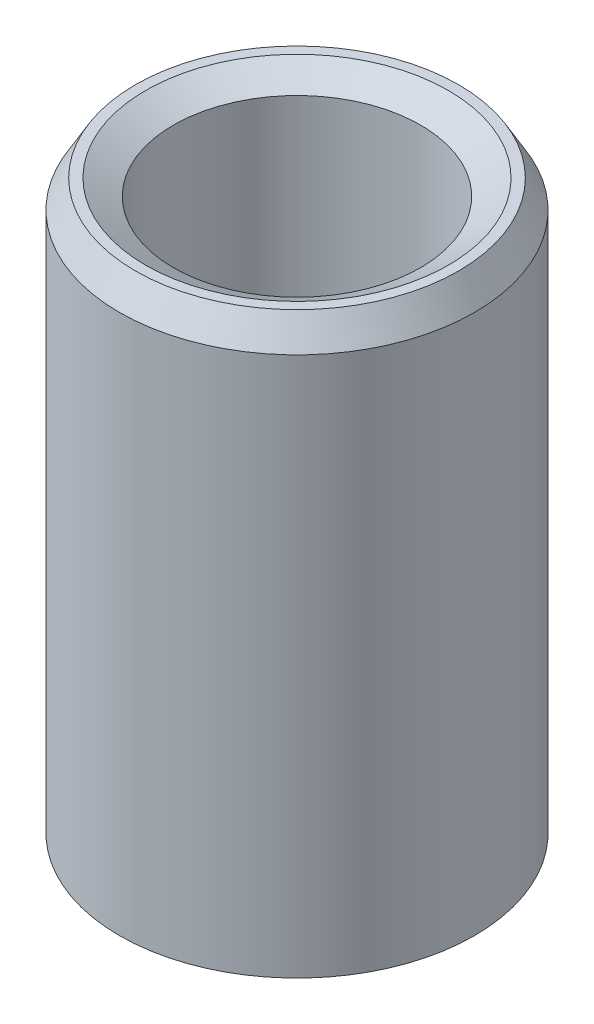
ISO-10303-21;
HEADER;
FILE_DESCRIPTION(('STEP AP214'),'2;1');
FILE_NAME('part.step','',(''),(''),'','','');
FILE_SCHEMA(('AUTOMOTIVE_DESIGN { 1 0 10303 214 1 1 1 1 }'));
ENDSEC;
DATA;
#1=APPLICATION_CONTEXT('core data for automotive mechanical design processes');
#2=APPLICATION_PROTOCOL_DEFINITION('international standard','automotive_design',2000,#1);
#3=PRODUCT_CONTEXT('',#1,'mechanical');
#4=PRODUCT('Part','Part','',(#3));
#5=PRODUCT_RELATED_PRODUCT_CATEGORY('part','',(#4));
#6=PRODUCT_DEFINITION_FORMATION('','',#4);
#7=PRODUCT_DEFINITION_CONTEXT('part definition',#1,'design');
#8=PRODUCT_DEFINITION('design','',#6,#7);
#9=PRODUCT_DEFINITION_SHAPE('','',#8);
#10=(LENGTH_UNIT() NAMED_UNIT(*) SI_UNIT(.MILLI.,.METRE.));
#11=(NAMED_UNIT(*) PLANE_ANGLE_UNIT() SI_UNIT($,.RADIAN.));
#12=(NAMED_UNIT(*) SI_UNIT($,.STERADIAN.) SOLID_ANGLE_UNIT());
#13=UNCERTAINTY_MEASURE_WITH_UNIT(LENGTH_MEASURE(1.E-05),#10,'distance_accuracy_value','');
#14=(GEOMETRIC_REPRESENTATION_CONTEXT(3) GLOBAL_UNCERTAINTY_ASSIGNED_CONTEXT((#13)) GLOBAL_UNIT_ASSIGNED_CONTEXT((#10,
#11,#12)) REPRESENTATION_CONTEXT('',''));
#15=CARTESIAN_POINT('',(0.,0.,0.));
#16=DIRECTION('',(0.,0.,1.));
#17=DIRECTION('',(1.,0.,0.));
#18=AXIS2_PLACEMENT_3D('',#15,#16,#17);
#19=CARTESIAN_POINT('',(0.,82.1864269688435,0.));
#20=DIRECTION('',(0.,-1.,0.));
#21=DIRECTION('',(0.,0.,-1.));
#22=AXIS2_PLACEMENT_3D('',#19,#20,#21);
#23=CYLINDRICAL_SURFACE('',#22,25.);
#24=CARTESIAN_POINT('',(0.,2.26073057082643,0.));
#25=DIRECTION('',(0.,1.,0.));
#26=DIRECTION('',(0.,0.,1.));
#27=AXIS2_PLACEMENT_3D('',#24,#25,#26);
#28=CIRCLE('',#27,25.);
#29=CARTESIAN_POINT('',(0.,2.26073057082643,25.));
#30=VERTEX_POINT('',#29);
#31=EDGE_CURVE('E10',#30,#30,#28,.T.);
#32=ORIENTED_EDGE('',*,*,#31,.T.);
#33=EDGE_LOOP('',(#32));
#34=FACE_BOUND('',#33,.T.);
#35=CARTESIAN_POINT('',(0.,78.270726757948,0.));
#36=DIRECTION('',(0.,1.,0.));
#37=DIRECTION('',(0.,0.,1.));
#38=AXIS2_PLACEMENT_3D('',#35,#36,#37);
#39=CIRCLE('',#38,25.);
#40=CARTESIAN_POINT('',(0.,78.270726757948,25.));
#41=VERTEX_POINT('',#40);
#42=EDGE_CURVE('E50',#41,#41,#39,.F.);
#43=ORIENTED_EDGE('',*,*,#42,.T.);
#44=EDGE_LOOP('',(#43));
#45=FACE_BOUND('',#44,.T.);
#46=ADVANCED_FACE('F39',(#34,#45),#23,.T.);
#47=CARTESIAN_POINT('',(0.,82.1864269688435,0.));
#48=DIRECTION('',(0.,1.,0.));
#49=DIRECTION('',(0.,0.,1.));
#50=AXIS2_PLACEMENT_3D('',#47,#48,#49);
#51=PLANE('',#50);
#52=CARTESIAN_POINT('',(0.,82.1864269688435,0.));
#53=DIRECTION('',(0.,1.,0.));
#54=DIRECTION('',(0.,0.,1.));
#55=AXIS2_PLACEMENT_3D('',#52,#53,#54);
#56=CIRCLE('',#55,21.3171710352749);
#57=CARTESIAN_POINT('',(0.,82.1864269688435,21.3171710352749));
#58=VERTEX_POINT('',#57);
#59=EDGE_CURVE('E58',#58,#58,#56,.F.);
#60=ORIENTED_EDGE('',*,*,#59,.T.);
#61=EDGE_LOOP('',(#60));
#62=FACE_BOUND('',#61,.T.);
#63=CARTESIAN_POINT('',(0.,82.1864269688435,0.));
#64=DIRECTION('',(0.,1.,0.));
#65=DIRECTION('',(0.,0.,1.));
#66=AXIS2_PLACEMENT_3D('',#63,#64,#65);
#67=CIRCLE('',#66,22.7392694291736);
#68=CARTESIAN_POINT('',(0.,82.1864269688435,22.7392694291736));
#69=VERTEX_POINT('',#68);
#70=EDGE_CURVE('E61',#69,#69,#67,.T.);
#71=ORIENTED_EDGE('',*,*,#70,.T.);
#72=EDGE_LOOP('',(#71));
#73=FACE_BOUND('',#72,.T.);
#74=ADVANCED_FACE('F88',(#62,#73),#51,.T.);
#75=CARTESIAN_POINT('',(0.,0.,0.));
#76=DIRECTION('',(0.,1.,0.));
#77=DIRECTION('',(0.,0.,1.));
#78=AXIS2_PLACEMENT_3D('',#75,#76,#77);
#79=PLANE('',#78);
#80=CARTESIAN_POINT('',(0.,0.,0.));
#81=DIRECTION('',(0.,1.,0.));
#82=DIRECTION('',(0.,0.,1.));
#83=AXIS2_PLACEMENT_3D('',#80,#81,#82);
#84=CIRCLE('',#83,19.6622013952058);
#85=CARTESIAN_POINT('',(0.,0.,19.6622013952058));
#86=VERTEX_POINT('',#85);
#87=EDGE_CURVE('E51',#86,#86,#84,.T.);
#88=ORIENTED_EDGE('',*,*,#87,.T.);
#89=EDGE_LOOP('',(#88));
#90=FACE_BOUND('',#89,.T.);
#91=CARTESIAN_POINT('',(0.,0.,0.));
#92=DIRECTION('',(0.,1.,0.));
#93=DIRECTION('',(0.,0.,1.));
#94=AXIS2_PLACEMENT_3D('',#91,#92,#93);
#95=CIRCLE('',#94,21.0842997891044);
#96=CARTESIAN_POINT('',(0.,0.,21.0842997891044));
#97=VERTEX_POINT('',#96);
#98=EDGE_CURVE('E54',#97,#97,#95,.F.);
#99=ORIENTED_EDGE('',*,*,#98,.T.);
#100=EDGE_LOOP('',(#99));
#101=FACE_BOUND('',#100,.T.);
#102=ADVANCED_FACE('F83',(#90,#101),#79,.F.);
#103=CARTESIAN_POINT('',(0.,82.1864269688435,0.));
#104=DIRECTION('',(0.,-1.,0.));
#105=DIRECTION('',(0.,0.,-1.));
#106=AXIS2_PLACEMENT_3D('',#103,#104,#105);
#107=CYLINDRICAL_SURFACE('',#106,17.4014708243794);
#108=CARTESIAN_POINT('',(0.,79.9256963980171,0.));
#109=DIRECTION('',(0.,1.,0.));
#110=DIRECTION('',(0.,0.,1.));
#111=AXIS2_PLACEMENT_3D('',#108,#109,#110);
#112=CIRCLE('',#111,17.4014708243794);
#113=CARTESIAN_POINT('',(0.,79.9256963980171,17.4014708243794));
#114=VERTEX_POINT('',#113);
#115=EDGE_CURVE('E67',#114,#114,#112,.T.);
#116=ORIENTED_EDGE('',*,*,#115,.T.);
#117=EDGE_LOOP('',(#116));
#118=FACE_BOUND('',#117,.T.);
#119=CARTESIAN_POINT('',(0.,3.91570021089559,0.));
#120=DIRECTION('',(0.,1.,0.));
#121=DIRECTION('',(0.,0.,1.));
#122=AXIS2_PLACEMENT_3D('',#119,#120,#121);
#123=CIRCLE('',#122,17.4014708243794);
#124=CARTESIAN_POINT('',(0.,3.91570021089559,17.4014708243794));
#125=VERTEX_POINT('',#124);
#126=EDGE_CURVE('E69',#125,#125,#123,.F.);
#127=ORIENTED_EDGE('',*,*,#126,.T.);
#128=EDGE_LOOP('',(#127));
#129=FACE_BOUND('',#128,.T.);
#130=ADVANCED_FACE('F71',(#118,#129),#107,.F.);
#131=CARTESIAN_POINT('',(0.,79.9256963980171,0.));
#132=DIRECTION('',(0.,1.,0.));
#133=DIRECTION('',(0.,0.,1.));
#134=AXIS2_PLACEMENT_3D('',#131,#132,#133);
#135=CONICAL_SURFACE('',#134,17.4014708243794,1.0471975511966);
#136=ORIENTED_EDGE('',*,*,#59,.F.);
#137=EDGE_LOOP('',(#136));
#138=FACE_BOUND('',#137,.T.);
#139=ORIENTED_EDGE('',*,*,#115,.F.);
#140=EDGE_LOOP('',(#139));
#141=FACE_BOUND('',#140,.T.);
#142=ADVANCED_FACE('F77',(#138,#141),#135,.F.);
#143=CARTESIAN_POINT('',(0.,0.,0.));
#144=DIRECTION('',(0.,-1.,0.));
#145=DIRECTION('',(0.,0.,-1.));
#146=AXIS2_PLACEMENT_3D('',#143,#144,#145);
#147=CONICAL_SURFACE('',#146,19.6622013952058,0.523598775598293);
#148=ORIENTED_EDGE('',*,*,#126,.F.);
#149=EDGE_LOOP('',(#148));
#150=FACE_BOUND('',#149,.T.);
#151=ORIENTED_EDGE('',*,*,#87,.F.);
#152=EDGE_LOOP('',(#151));
#153=FACE_BOUND('',#152,.T.);
#154=ADVANCED_FACE('F73',(#150,#153),#147,.F.);
#155=CARTESIAN_POINT('',(0.,2.26073057082643,0.));
#156=DIRECTION('',(0.,1.,0.));
#157=DIRECTION('',(0.,0.,1.));
#158=AXIS2_PLACEMENT_3D('',#155,#156,#157);
#159=CONICAL_SURFACE('',#158,25.,1.0471975511966);
#160=ORIENTED_EDGE('',*,*,#98,.F.);
#161=EDGE_LOOP('',(#160));
#162=FACE_BOUND('',#161,.T.);
#163=ORIENTED_EDGE('',*,*,#31,.F.);
#164=EDGE_LOOP('',(#163));
#165=FACE_BOUND('',#164,.T.);
#166=ADVANCED_FACE('F76',(#162,#165),#159,.T.);
#167=CARTESIAN_POINT('',(0.,82.1864269688435,0.));
#168=DIRECTION('',(0.,-1.,0.));
#169=DIRECTION('',(0.,0.,-1.));
#170=AXIS2_PLACEMENT_3D('',#167,#168,#169);
#171=CONICAL_SURFACE('',#170,22.7392694291736,0.523598775598292);
#172=ORIENTED_EDGE('',*,*,#42,.F.);
#173=EDGE_LOOP('',(#172));
#174=FACE_BOUND('',#173,.T.);
#175=ORIENTED_EDGE('',*,*,#70,.F.);
#176=EDGE_LOOP('',(#175));
#177=FACE_BOUND('',#176,.T.);
#178=ADVANCED_FACE('F45',(#174,#177),#171,.T.);
#179=CLOSED_SHELL('',(#46,#74,#102,#130,#142,#154,#166,#178));
#180=MANIFOLD_SOLID_BREP('B2',#179);
#181=ADVANCED_BREP_SHAPE_REPRESENTATION('',(#18,#180),#14);
#182=SHAPE_DEFINITION_REPRESENTATION(#9,#181);
ENDSEC;
END-ISO-10303-21;
